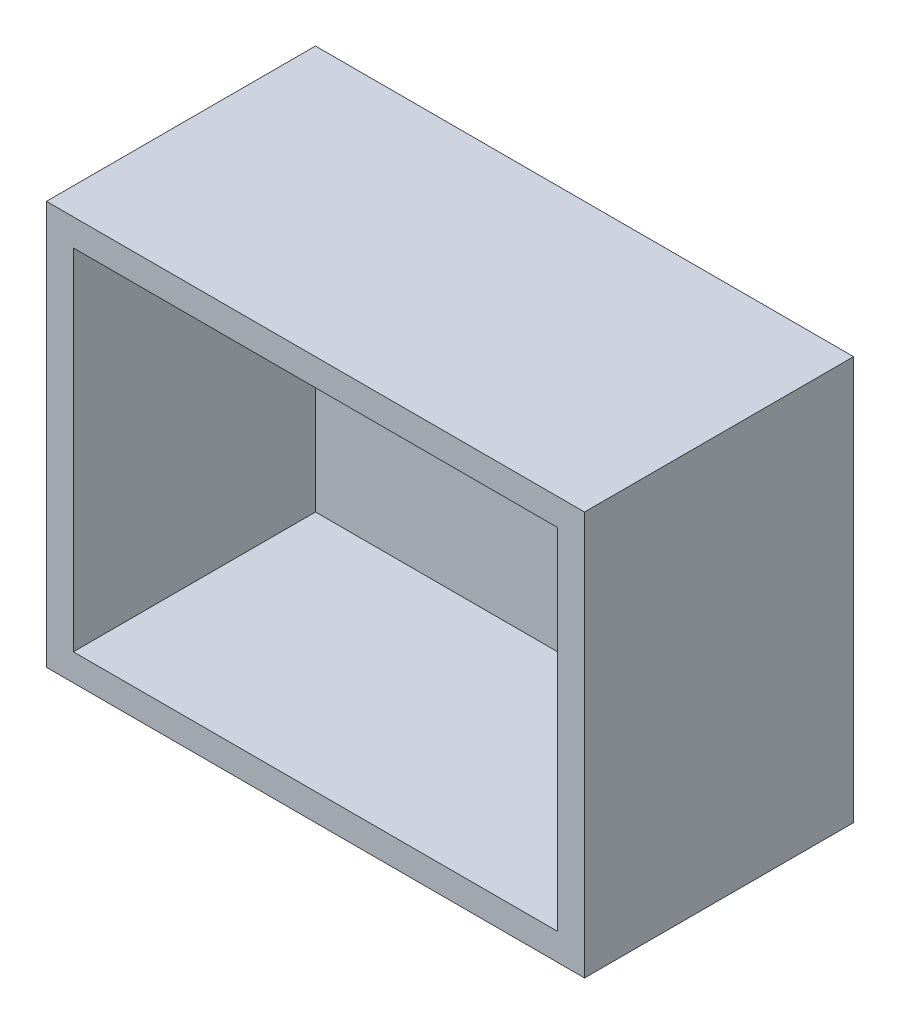
ISO-10303-21;
HEADER;
FILE_DESCRIPTION(('STEP AP214'),'2;1');
FILE_NAME('part.step','',(''),(''),'','','');
FILE_SCHEMA(('AUTOMOTIVE_DESIGN { 1 0 10303 214 1 1 1 1 }'));
ENDSEC;
DATA;
#1=APPLICATION_CONTEXT('core data for automotive mechanical design processes');
#2=APPLICATION_PROTOCOL_DEFINITION('international standard','automotive_design',2000,#1);
#3=PRODUCT_CONTEXT('',#1,'mechanical');
#4=PRODUCT('Part','Part','',(#3));
#5=PRODUCT_RELATED_PRODUCT_CATEGORY('part','',(#4));
#6=PRODUCT_DEFINITION_FORMATION('','',#4);
#7=PRODUCT_DEFINITION_CONTEXT('part definition',#1,'design');
#8=PRODUCT_DEFINITION('design','',#6,#7);
#9=PRODUCT_DEFINITION_SHAPE('','',#8);
#10=(LENGTH_UNIT() NAMED_UNIT(*) SI_UNIT(.MILLI.,.METRE.));
#11=(NAMED_UNIT(*) PLANE_ANGLE_UNIT() SI_UNIT($,.RADIAN.));
#12=(NAMED_UNIT(*) SI_UNIT($,.STERADIAN.) SOLID_ANGLE_UNIT());
#13=UNCERTAINTY_MEASURE_WITH_UNIT(LENGTH_MEASURE(1.E-05),#10,'distance_accuracy_value','');
#14=(GEOMETRIC_REPRESENTATION_CONTEXT(3) GLOBAL_UNCERTAINTY_ASSIGNED_CONTEXT((#13)) GLOBAL_UNIT_ASSIGNED_CONTEXT((#10,
#11,#12)) REPRESENTATION_CONTEXT('',''));
#15=CARTESIAN_POINT('',(0.,0.,0.));
#16=DIRECTION('',(0.,0.,1.));
#17=DIRECTION('',(1.,0.,0.));
#18=AXIS2_PLACEMENT_3D('',#15,#16,#17);
#19=CARTESIAN_POINT('',(0.,0.,20.));
#20=DIRECTION('',(0.,0.,1.));
#21=DIRECTION('',(1.,0.,0.));
#22=AXIS2_PLACEMENT_3D('',#19,#20,#21);
#23=PLANE('',#22);
#24=DIRECTION('',(0.,-1.,0.));
#25=VECTOR('',#24,1.);
#26=CARTESIAN_POINT('',(-14.6254856647816,27.5182805690849,20.));
#27=LINE('',#26,#25);
#28=CARTESIAN_POINT('',(-14.6254856647816,27.5182805690849,20.));
#29=VERTEX_POINT('',#28);
#30=CARTESIAN_POINT('',(-14.6254856647816,-2.48171943091514,20.));
#31=VERTEX_POINT('',#30);
#32=EDGE_CURVE('E173',#29,#31,#27,.T.);
#33=ORIENTED_EDGE('',*,*,#32,.T.);
#34=DIRECTION('',(1.,0.,0.));
#35=VECTOR('',#34,1.);
#36=CARTESIAN_POINT('',(-14.6254856647816,-2.48171943091514,20.));
#37=LINE('',#36,#35);
#38=CARTESIAN_POINT('',(25.3745143352184,-2.48171943091514,20.));
#39=VERTEX_POINT('',#38);
#40=EDGE_CURVE('E100',#31,#39,#37,.T.);
#41=ORIENTED_EDGE('',*,*,#40,.T.);
#42=DIRECTION('',(0.,1.,0.));
#43=VECTOR('',#42,1.);
#44=CARTESIAN_POINT('',(25.3745143352184,27.5182805690849,20.));
#45=LINE('',#44,#43);
#46=CARTESIAN_POINT('',(25.3745143352184,27.5182805690849,20.));
#47=VERTEX_POINT('',#46);
#48=EDGE_CURVE('E178',#39,#47,#45,.T.);
#49=ORIENTED_EDGE('',*,*,#48,.T.);
#50=DIRECTION('',(-1.,0.,0.));
#51=VECTOR('',#50,1.);
#52=CARTESIAN_POINT('',(-14.6254856647816,27.5182805690849,20.));
#53=LINE('',#52,#51);
#54=EDGE_CURVE('E72',#47,#29,#53,.T.);
#55=ORIENTED_EDGE('',*,*,#54,.T.);
#56=EDGE_LOOP('',(#33,#41,#49,#55));
#57=FACE_BOUND('',#56,.T.);
#58=DIRECTION('',(0.,-1.,0.));
#59=VECTOR('',#58,1.);
#60=CARTESIAN_POINT('',(-12.6254856647816,0.,20.));
#61=LINE('',#60,#59);
#62=CARTESIAN_POINT('',(-12.6254856647816,25.5182805690849,20.));
#63=VERTEX_POINT('',#62);
#64=CARTESIAN_POINT('',(-12.6254856647816,-0.481719430915135,20.));
#65=VERTEX_POINT('',#64);
#66=EDGE_CURVE('E154',#63,#65,#61,.T.);
#67=ORIENTED_EDGE('',*,*,#66,.F.);
#68=DIRECTION('',(1.,0.,0.));
#69=VECTOR('',#68,1.);
#70=CARTESIAN_POINT('',(0.,25.5182805690849,20.));
#71=LINE('',#70,#69);
#72=CARTESIAN_POINT('',(23.3745143352184,25.5182805690849,20.));
#73=VERTEX_POINT('',#72);
#74=EDGE_CURVE('E63',#63,#73,#71,.T.);
#75=ORIENTED_EDGE('',*,*,#74,.T.);
#76=DIRECTION('',(0.,-1.,0.));
#77=VECTOR('',#76,1.);
#78=CARTESIAN_POINT('',(23.3745143352184,0.,20.));
#79=LINE('',#78,#77);
#80=CARTESIAN_POINT('',(23.3745143352184,-0.481719430915135,20.));
#81=VERTEX_POINT('',#80);
#82=EDGE_CURVE('E140',#73,#81,#79,.T.);
#83=ORIENTED_EDGE('',*,*,#82,.T.);
#84=DIRECTION('',(1.,0.,0.));
#85=VECTOR('',#84,1.);
#86=CARTESIAN_POINT('',(0.,-0.481719430915135,20.));
#87=LINE('',#86,#85);
#88=EDGE_CURVE('E157',#65,#81,#87,.T.);
#89=ORIENTED_EDGE('',*,*,#88,.F.);
#90=EDGE_LOOP('',(#67,#75,#83,#89));
#91=FACE_BOUND('',#90,.T.);
#92=ADVANCED_FACE('F47',(#57,#91),#23,.T.);
#93=CARTESIAN_POINT('',(-14.6254856647816,27.5182805690849,20.));
#94=DIRECTION('',(1.,0.,0.));
#95=DIRECTION('',(0.,1.,0.));
#96=AXIS2_PLACEMENT_3D('',#93,#94,#95);
#97=PLANE('',#96);
#98=DIRECTION('',(0.,-1.,0.));
#99=VECTOR('',#98,1.);
#100=CARTESIAN_POINT('',(-14.6254856647816,27.5182805690849,0.));
#101=LINE('',#100,#99);
#102=CARTESIAN_POINT('',(-14.6254856647816,27.5182805690849,0.));
#103=VERTEX_POINT('',#102);
#104=CARTESIAN_POINT('',(-14.6254856647816,-2.48171943091514,0.));
#105=VERTEX_POINT('',#104);
#106=EDGE_CURVE('E167',#103,#105,#101,.T.);
#107=ORIENTED_EDGE('',*,*,#106,.T.);
#108=DIRECTION('',(0.,0.,-1.));
#109=VECTOR('',#108,1.);
#110=CARTESIAN_POINT('',(-14.6254856647816,-2.48171943091514,20.));
#111=LINE('',#110,#109);
#112=EDGE_CURVE('E11',#31,#105,#111,.T.);
#113=ORIENTED_EDGE('',*,*,#112,.F.);
#114=ORIENTED_EDGE('',*,*,#32,.F.);
#115=DIRECTION('',(0.,0.,-1.));
#116=VECTOR('',#115,1.);
#117=CARTESIAN_POINT('',(-14.6254856647816,27.5182805690849,20.));
#118=LINE('',#117,#116);
#119=EDGE_CURVE('E183',#29,#103,#118,.T.);
#120=ORIENTED_EDGE('',*,*,#119,.T.);
#121=EDGE_LOOP('',(#107,#113,#114,#120));
#122=FACE_BOUND('',#121,.T.);
#123=ADVANCED_FACE('F49',(#122),#97,.F.);
#124=CARTESIAN_POINT('',(-14.6254856647816,-2.48171943091514,20.));
#125=DIRECTION('',(0.,1.,0.));
#126=DIRECTION('',(0.,0.,1.));
#127=AXIS2_PLACEMENT_3D('',#124,#125,#126);
#128=PLANE('',#127);
#129=DIRECTION('',(1.,0.,0.));
#130=VECTOR('',#129,1.);
#131=CARTESIAN_POINT('',(-14.6254856647816,-2.48171943091514,0.));
#132=LINE('',#131,#130);
#133=CARTESIAN_POINT('',(25.3745143352184,-2.48171943091514,0.));
#134=VERTEX_POINT('',#133);
#135=EDGE_CURVE('E187',#105,#134,#132,.T.);
#136=ORIENTED_EDGE('',*,*,#135,.T.);
#137=DIRECTION('',(0.,0.,-1.));
#138=VECTOR('',#137,1.);
#139=CARTESIAN_POINT('',(25.3745143352184,-2.48171943091514,20.));
#140=LINE('',#139,#138);
#141=EDGE_CURVE('E56',#39,#134,#140,.T.);
#142=ORIENTED_EDGE('',*,*,#141,.F.);
#143=ORIENTED_EDGE('',*,*,#40,.F.);
#144=ORIENTED_EDGE('',*,*,#112,.T.);
#145=EDGE_LOOP('',(#136,#142,#143,#144));
#146=FACE_BOUND('',#145,.T.);
#147=ADVANCED_FACE('F220',(#146),#128,.F.);
#148=CARTESIAN_POINT('',(25.3745143352184,27.5182805690849,20.));
#149=DIRECTION('',(-1.,0.,0.));
#150=DIRECTION('',(0.,0.,1.));
#151=AXIS2_PLACEMENT_3D('',#148,#149,#150);
#152=PLANE('',#151);
#153=DIRECTION('',(0.,1.,0.));
#154=VECTOR('',#153,1.);
#155=CARTESIAN_POINT('',(25.3745143352184,27.5182805690849,0.));
#156=LINE('',#155,#154);
#157=CARTESIAN_POINT('',(25.3745143352184,27.5182805690849,0.));
#158=VERTEX_POINT('',#157);
#159=EDGE_CURVE('E190',#134,#158,#156,.T.);
#160=ORIENTED_EDGE('',*,*,#159,.T.);
#161=DIRECTION('',(0.,0.,-1.));
#162=VECTOR('',#161,1.);
#163=CARTESIAN_POINT('',(25.3745143352184,27.5182805690849,20.));
#164=LINE('',#163,#162);
#165=EDGE_CURVE('E197',#47,#158,#164,.T.);
#166=ORIENTED_EDGE('',*,*,#165,.F.);
#167=ORIENTED_EDGE('',*,*,#48,.F.);
#168=ORIENTED_EDGE('',*,*,#141,.T.);
#169=EDGE_LOOP('',(#160,#166,#167,#168));
#170=FACE_BOUND('',#169,.T.);
#171=ADVANCED_FACE('F204',(#170),#152,.F.);
#172=CARTESIAN_POINT('',(-14.6254856647816,27.5182805690849,20.));
#173=DIRECTION('',(0.,-1.,0.));
#174=DIRECTION('',(1.,0.,0.));
#175=AXIS2_PLACEMENT_3D('',#172,#173,#174);
#176=PLANE('',#175);
#177=DIRECTION('',(-1.,0.,0.));
#178=VECTOR('',#177,1.);
#179=CARTESIAN_POINT('',(-14.6254856647816,27.5182805690849,0.));
#180=LINE('',#179,#178);
#181=EDGE_CURVE('E93',#158,#103,#180,.T.);
#182=ORIENTED_EDGE('',*,*,#181,.T.);
#183=ORIENTED_EDGE('',*,*,#119,.F.);
#184=ORIENTED_EDGE('',*,*,#54,.F.);
#185=ORIENTED_EDGE('',*,*,#165,.T.);
#186=EDGE_LOOP('',(#182,#183,#184,#185));
#187=FACE_BOUND('',#186,.T.);
#188=ADVANCED_FACE('F212',(#187),#176,.F.);
#189=CARTESIAN_POINT('',(0.,0.,0.));
#190=DIRECTION('',(0.,0.,1.));
#191=DIRECTION('',(1.,0.,0.));
#192=AXIS2_PLACEMENT_3D('',#189,#190,#191);
#193=PLANE('',#192);
#194=ORIENTED_EDGE('',*,*,#106,.F.);
#195=ORIENTED_EDGE('',*,*,#181,.F.);
#196=ORIENTED_EDGE('',*,*,#159,.F.);
#197=ORIENTED_EDGE('',*,*,#135,.F.);
#198=EDGE_LOOP('',(#194,#195,#196,#197));
#199=FACE_BOUND('',#198,.T.);
#200=ADVANCED_FACE('F208',(#199),#193,.F.);
#201=CARTESIAN_POINT('',(0.,25.5182805690849,2.));
#202=DIRECTION('',(0.,-1.,0.));
#203=DIRECTION('',(0.,0.,-1.));
#204=AXIS2_PLACEMENT_3D('',#201,#202,#203);
#205=PLANE('',#204);
#206=ORIENTED_EDGE('',*,*,#74,.F.);
#207=DIRECTION('',(0.,0.,1.));
#208=VECTOR('',#207,1.);
#209=CARTESIAN_POINT('',(-12.6254856647816,25.5182805690849,2.));
#210=LINE('',#209,#208);
#211=CARTESIAN_POINT('',(-12.6254856647816,25.5182805690849,2.));
#212=VERTEX_POINT('',#211);
#213=EDGE_CURVE('E121',#212,#63,#210,.T.);
#214=ORIENTED_EDGE('',*,*,#213,.F.);
#215=DIRECTION('',(1.,0.,0.));
#216=VECTOR('',#215,1.);
#217=CARTESIAN_POINT('',(0.,25.5182805690849,2.));
#218=LINE('',#217,#216);
#219=CARTESIAN_POINT('',(23.3745143352184,25.5182805690849,2.));
#220=VERTEX_POINT('',#219);
#221=EDGE_CURVE('E124',#212,#220,#218,.T.);
#222=ORIENTED_EDGE('',*,*,#221,.T.);
#223=DIRECTION('',(0.,0.,1.));
#224=VECTOR('',#223,1.);
#225=CARTESIAN_POINT('',(23.3745143352184,25.5182805690849,2.));
#226=LINE('',#225,#224);
#227=EDGE_CURVE('E164',#220,#73,#226,.T.);
#228=ORIENTED_EDGE('',*,*,#227,.T.);
#229=EDGE_LOOP('',(#206,#214,#222,#228));
#230=FACE_BOUND('',#229,.T.);
#231=ADVANCED_FACE('F123',(#230),#205,.T.);
#232=CARTESIAN_POINT('',(23.3745143352184,0.,2.));
#233=DIRECTION('',(-1.,0.,0.));
#234=DIRECTION('',(0.,-1.,0.));
#235=AXIS2_PLACEMENT_3D('',#232,#233,#234);
#236=PLANE('',#235);
#237=ORIENTED_EDGE('',*,*,#82,.F.);
#238=ORIENTED_EDGE('',*,*,#227,.F.);
#239=DIRECTION('',(0.,-1.,0.));
#240=VECTOR('',#239,1.);
#241=CARTESIAN_POINT('',(23.3745143352184,0.,2.));
#242=LINE('',#241,#240);
#243=CARTESIAN_POINT('',(23.3745143352184,-0.481719430915135,2.));
#244=VERTEX_POINT('',#243);
#245=EDGE_CURVE('E132',#220,#244,#242,.T.);
#246=ORIENTED_EDGE('',*,*,#245,.T.);
#247=DIRECTION('',(0.,0.,1.));
#248=VECTOR('',#247,1.);
#249=CARTESIAN_POINT('',(23.3745143352184,-0.481719430915135,2.));
#250=LINE('',#249,#248);
#251=EDGE_CURVE('E168',#244,#81,#250,.T.);
#252=ORIENTED_EDGE('',*,*,#251,.T.);
#253=EDGE_LOOP('',(#237,#238,#246,#252));
#254=FACE_BOUND('',#253,.T.);
#255=ADVANCED_FACE('F231',(#254),#236,.T.);
#256=CARTESIAN_POINT('',(0.,-0.481719430915135,2.));
#257=DIRECTION('',(0.,-1.,0.));
#258=DIRECTION('',(1.,0.,0.));
#259=AXIS2_PLACEMENT_3D('',#256,#257,#258);
#260=PLANE('',#259);
#261=ORIENTED_EDGE('',*,*,#88,.T.);
#262=ORIENTED_EDGE('',*,*,#251,.F.);
#263=DIRECTION('',(1.,0.,0.));
#264=VECTOR('',#263,1.);
#265=CARTESIAN_POINT('',(0.,-0.481719430915135,2.));
#266=LINE('',#265,#264);
#267=CARTESIAN_POINT('',(-12.6254856647816,-0.481719430915135,2.));
#268=VERTEX_POINT('',#267);
#269=EDGE_CURVE('E145',#268,#244,#266,.T.);
#270=ORIENTED_EDGE('',*,*,#269,.F.);
#271=DIRECTION('',(0.,0.,1.));
#272=VECTOR('',#271,1.);
#273=CARTESIAN_POINT('',(-12.6254856647816,-0.481719430915135,2.));
#274=LINE('',#273,#272);
#275=EDGE_CURVE('E131',#268,#65,#274,.T.);
#276=ORIENTED_EDGE('',*,*,#275,.T.);
#277=EDGE_LOOP('',(#261,#262,#270,#276));
#278=FACE_BOUND('',#277,.T.);
#279=ADVANCED_FACE('F234',(#278),#260,.F.);
#280=CARTESIAN_POINT('',(-12.6254856647816,0.,2.));
#281=DIRECTION('',(-1.,0.,0.));
#282=DIRECTION('',(0.,0.,1.));
#283=AXIS2_PLACEMENT_3D('',#280,#281,#282);
#284=PLANE('',#283);
#285=ORIENTED_EDGE('',*,*,#66,.T.);
#286=ORIENTED_EDGE('',*,*,#275,.F.);
#287=DIRECTION('',(0.,-1.,0.));
#288=VECTOR('',#287,1.);
#289=CARTESIAN_POINT('',(-12.6254856647816,0.,2.));
#290=LINE('',#289,#288);
#291=EDGE_CURVE('E138',#212,#268,#290,.T.);
#292=ORIENTED_EDGE('',*,*,#291,.F.);
#293=ORIENTED_EDGE('',*,*,#213,.T.);
#294=EDGE_LOOP('',(#285,#286,#292,#293));
#295=FACE_BOUND('',#294,.T.);
#296=ADVANCED_FACE('F142',(#295),#284,.F.);
#297=CARTESIAN_POINT('',(0.,0.,2.));
#298=DIRECTION('',(0.,0.,1.));
#299=DIRECTION('',(1.,0.,0.));
#300=AXIS2_PLACEMENT_3D('',#297,#298,#299);
#301=PLANE('',#300);
#302=ORIENTED_EDGE('',*,*,#221,.F.);
#303=ORIENTED_EDGE('',*,*,#291,.T.);
#304=ORIENTED_EDGE('',*,*,#269,.T.);
#305=ORIENTED_EDGE('',*,*,#245,.F.);
#306=EDGE_LOOP('',(#302,#303,#304,#305));
#307=FACE_BOUND('',#306,.T.);
#308=ADVANCED_FACE('F136',(#307),#301,.T.);
#309=CLOSED_SHELL('',(#92,#123,#147,#171,#188,#200,#231,#255,#279,#296,#308));
#310=MANIFOLD_SOLID_BREP('B2',#309);
#311=ADVANCED_BREP_SHAPE_REPRESENTATION('',(#18,#310),#14);
#312=SHAPE_DEFINITION_REPRESENTATION(#9,#311);
ENDSEC;
END-ISO-10303-21;
